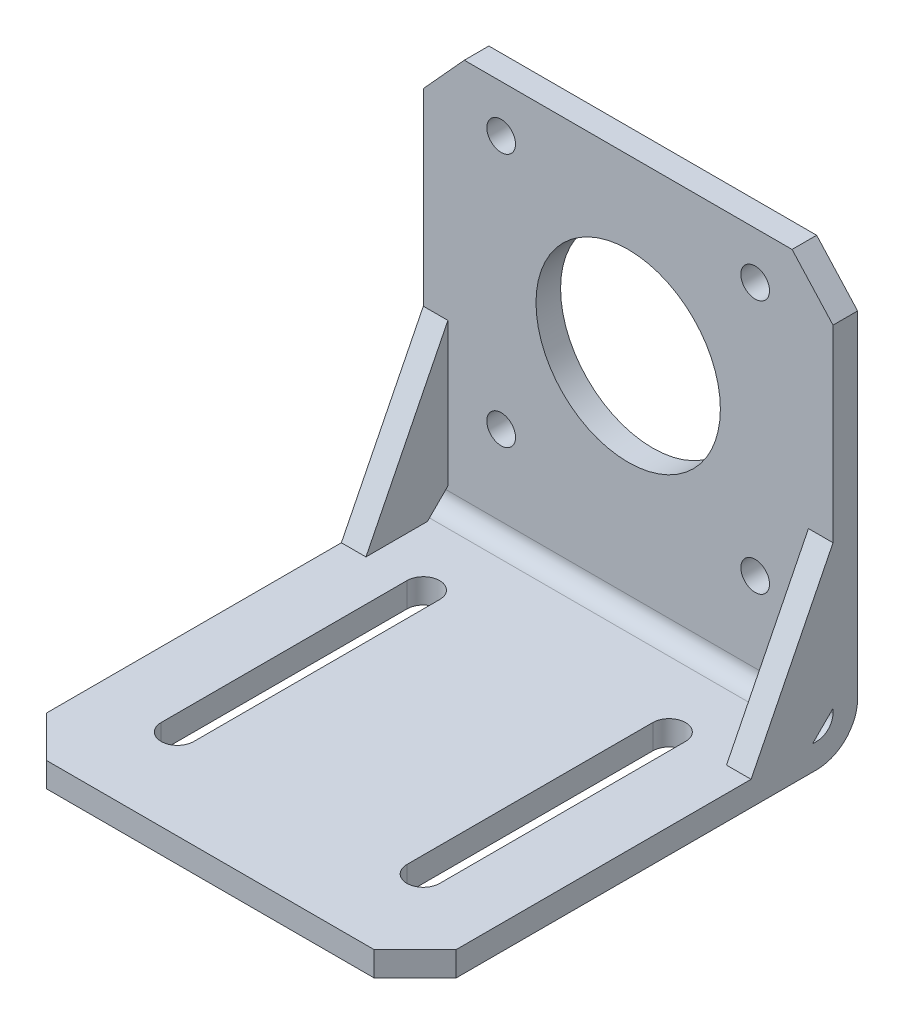
ISO-10303-21;
HEADER;
FILE_DESCRIPTION(('STEP AP214'),'2;1');
FILE_NAME('part.step','',(''),(''),'','','');
FILE_SCHEMA(('AUTOMOTIVE_DESIGN { 1 0 10303 214 1 1 1 1 }'));
ENDSEC;
DATA;
#1=APPLICATION_CONTEXT('core data for automotive mechanical design processes');
#2=APPLICATION_PROTOCOL_DEFINITION('international standard','automotive_design',2000,#1);
#3=PRODUCT_CONTEXT('',#1,'mechanical');
#4=PRODUCT('Part','Part','',(#3));
#5=PRODUCT_RELATED_PRODUCT_CATEGORY('part','',(#4));
#6=PRODUCT_DEFINITION_FORMATION('','',#4);
#7=PRODUCT_DEFINITION_CONTEXT('part definition',#1,'design');
#8=PRODUCT_DEFINITION('design','',#6,#7);
#9=PRODUCT_DEFINITION_SHAPE('','',#8);
#10=(LENGTH_UNIT() NAMED_UNIT(*) SI_UNIT(.MILLI.,.METRE.));
#11=(NAMED_UNIT(*) PLANE_ANGLE_UNIT() SI_UNIT($,.RADIAN.));
#12=(NAMED_UNIT(*) SI_UNIT($,.STERADIAN.) SOLID_ANGLE_UNIT());
#13=UNCERTAINTY_MEASURE_WITH_UNIT(LENGTH_MEASURE(1.E-05),#10,'distance_accuracy_value','');
#14=(GEOMETRIC_REPRESENTATION_CONTEXT(3) GLOBAL_UNCERTAINTY_ASSIGNED_CONTEXT((#13)) GLOBAL_UNIT_ASSIGNED_CONTEXT((#10,
#11,#12)) REPRESENTATION_CONTEXT('',''));
#15=CARTESIAN_POINT('',(0.,0.,0.));
#16=DIRECTION('',(0.,0.,1.));
#17=DIRECTION('',(1.,0.,0.));
#18=AXIS2_PLACEMENT_3D('',#15,#16,#17);
#19=CARTESIAN_POINT('',(0.,0.,3.));
#20=DIRECTION('',(0.,0.,-1.));
#21=DIRECTION('',(-1.,0.,0.));
#22=AXIS2_PLACEMENT_3D('',#19,#20,#21);
#23=PLANE('',#22);
#24=CARTESIAN_POINT('',(0.,30.25,3.));
#25=DIRECTION('',(0.,0.,1.));
#26=DIRECTION('',(1.,0.,0.));
#27=AXIS2_PLACEMENT_3D('',#24,#25,#26);
#28=CIRCLE('',#27,11.25);
#29=CARTESIAN_POINT('',(11.25,30.25,3.));
#30=VERTEX_POINT('',#29);
#31=EDGE_CURVE('E405',#30,#30,#28,.T.);
#32=ORIENTED_EDGE('',*,*,#31,.F.);
#33=EDGE_LOOP('',(#32));
#34=FACE_BOUND('',#33,.T.);
#35=CARTESIAN_POINT('',(15.5,45.75,3.));
#36=DIRECTION('',(0.,0.,1.));
#37=DIRECTION('',(1.,0.,0.));
#38=AXIS2_PLACEMENT_3D('',#35,#36,#37);
#39=CIRCLE('',#38,1.75);
#40=CARTESIAN_POINT('',(17.25,45.75,3.));
#41=VERTEX_POINT('',#40);
#42=EDGE_CURVE('E399',#41,#41,#39,.T.);
#43=ORIENTED_EDGE('',*,*,#42,.F.);
#44=EDGE_LOOP('',(#43));
#45=FACE_BOUND('',#44,.T.);
#46=CARTESIAN_POINT('',(15.5,14.75,3.));
#47=DIRECTION('',(0.,0.,1.));
#48=DIRECTION('',(1.,0.,0.));
#49=AXIS2_PLACEMENT_3D('',#46,#47,#48);
#50=CIRCLE('',#49,1.75);
#51=CARTESIAN_POINT('',(17.25,14.75,3.));
#52=VERTEX_POINT('',#51);
#53=EDGE_CURVE('E393',#52,#52,#50,.T.);
#54=ORIENTED_EDGE('',*,*,#53,.F.);
#55=EDGE_LOOP('',(#54));
#56=FACE_BOUND('',#55,.T.);
#57=CARTESIAN_POINT('',(-15.5,14.75,3.));
#58=DIRECTION('',(0.,0.,1.));
#59=DIRECTION('',(-1.,0.,0.));
#60=AXIS2_PLACEMENT_3D('',#57,#58,#59);
#61=CIRCLE('',#60,1.75);
#62=CARTESIAN_POINT('',(-17.25,14.75,3.));
#63=VERTEX_POINT('',#62);
#64=EDGE_CURVE('E387',#63,#63,#61,.T.);
#65=ORIENTED_EDGE('',*,*,#64,.F.);
#66=EDGE_LOOP('',(#65));
#67=FACE_BOUND('',#66,.T.);
#68=CARTESIAN_POINT('',(-15.5,45.75,3.));
#69=DIRECTION('',(0.,0.,1.));
#70=DIRECTION('',(-1.,0.,0.));
#71=AXIS2_PLACEMENT_3D('',#68,#69,#70);
#72=CIRCLE('',#71,1.75);
#73=CARTESIAN_POINT('',(-17.25,45.75,3.));
#74=VERTEX_POINT('',#73);
#75=EDGE_CURVE('E381',#74,#74,#72,.T.);
#76=ORIENTED_EDGE('',*,*,#75,.F.);
#77=EDGE_LOOP('',(#76));
#78=FACE_BOUND('',#77,.T.);
#79=DIRECTION('',(1.,0.,0.));
#80=VECTOR('',#79,1.);
#81=CARTESIAN_POINT('',(22.,5.49999999999999,3.));
#82=LINE('',#81,#80);
#83=CARTESIAN_POINT('',(22.,5.49999999999999,3.));
#84=VERTEX_POINT('',#83);
#85=CARTESIAN_POINT('',(25.,5.49999999999999,3.));
#86=VERTEX_POINT('',#85);
#87=EDGE_CURVE('E53',#84,#86,#82,.T.);
#88=ORIENTED_EDGE('',*,*,#87,.F.);
#89=DIRECTION('',(0.,1.,0.));
#90=VECTOR('',#89,1.);
#91=CARTESIAN_POINT('',(22.,46.0000000000001,3.));
#92=LINE('',#91,#90);
#93=CARTESIAN_POINT('',(22.,23.,3.));
#94=VERTEX_POINT('',#93);
#95=EDGE_CURVE('E58',#84,#94,#92,.T.);
#96=ORIENTED_EDGE('',*,*,#95,.T.);
#97=DIRECTION('',(1.,0.,0.));
#98=VECTOR('',#97,1.);
#99=CARTESIAN_POINT('',(22.,23.,3.));
#100=LINE('',#99,#98);
#101=CARTESIAN_POINT('',(25.,23.,3.));
#102=VERTEX_POINT('',#101);
#103=EDGE_CURVE('E253',#94,#102,#100,.T.);
#104=ORIENTED_EDGE('',*,*,#103,.T.);
#105=DIRECTION('',(0.,1.,0.));
#106=VECTOR('',#105,1.);
#107=CARTESIAN_POINT('',(25.,46.0000000000001,3.));
#108=LINE('',#107,#106);
#109=CARTESIAN_POINT('',(25.,46.0000000000001,3.));
#110=VERTEX_POINT('',#109);
#111=EDGE_CURVE('E422',#102,#110,#108,.T.);
#112=ORIENTED_EDGE('',*,*,#111,.T.);
#113=DIRECTION('',(-0.672672793996322,0.739940073395936,0.));
#114=VECTOR('',#113,1.);
#115=CARTESIAN_POINT('',(20.,51.5,3.));
#116=LINE('',#115,#114);
#117=CARTESIAN_POINT('',(20.,51.5,3.));
#118=VERTEX_POINT('',#117);
#119=EDGE_CURVE('E411',#110,#118,#116,.T.);
#120=ORIENTED_EDGE('',*,*,#119,.T.);
#121=DIRECTION('',(-1.,0.,0.));
#122=VECTOR('',#121,1.);
#123=CARTESIAN_POINT('',(-20.,51.5,3.));
#124=LINE('',#123,#122);
#125=CARTESIAN_POINT('',(-20.,51.5,3.));
#126=VERTEX_POINT('',#125);
#127=EDGE_CURVE('E414',#118,#126,#124,.T.);
#128=ORIENTED_EDGE('',*,*,#127,.T.);
#129=DIRECTION('',(-0.672672793996322,-0.739940073395936,0.));
#130=VECTOR('',#129,1.);
#131=CARTESIAN_POINT('',(-20.,51.5,3.));
#132=LINE('',#131,#130);
#133=CARTESIAN_POINT('',(-25.,46.0000000000001,3.));
#134=VERTEX_POINT('',#133);
#135=EDGE_CURVE('E417',#126,#134,#132,.T.);
#136=ORIENTED_EDGE('',*,*,#135,.T.);
#137=DIRECTION('',(0.,-1.,0.));
#138=VECTOR('',#137,1.);
#139=CARTESIAN_POINT('',(-25.,46.0000000000001,3.));
#140=LINE('',#139,#138);
#141=CARTESIAN_POINT('',(-25.,23.,3.));
#142=VERTEX_POINT('',#141);
#143=EDGE_CURVE('E420',#134,#142,#140,.T.);
#144=ORIENTED_EDGE('',*,*,#143,.T.);
#145=DIRECTION('',(-1.,0.,0.));
#146=VECTOR('',#145,1.);
#147=CARTESIAN_POINT('',(-22.,23.,3.));
#148=LINE('',#147,#146);
#149=CARTESIAN_POINT('',(-22.,23.,3.));
#150=VERTEX_POINT('',#149);
#151=EDGE_CURVE('E270',#150,#142,#148,.T.);
#152=ORIENTED_EDGE('',*,*,#151,.F.);
#153=DIRECTION('',(0.,1.,0.));
#154=VECTOR('',#153,1.);
#155=CARTESIAN_POINT('',(-22.,0.,3.));
#156=LINE('',#155,#154);
#157=CARTESIAN_POINT('',(-22.,5.5,3.));
#158=VERTEX_POINT('',#157);
#159=EDGE_CURVE('E256',#158,#150,#156,.T.);
#160=ORIENTED_EDGE('',*,*,#159,.F.);
#161=DIRECTION('',(-1.,0.,0.));
#162=VECTOR('',#161,1.);
#163=CARTESIAN_POINT('',(-22.,5.5,3.));
#164=LINE('',#163,#162);
#165=CARTESIAN_POINT('',(-25.,5.5,3.));
#166=VERTEX_POINT('',#165);
#167=EDGE_CURVE('E267',#158,#166,#164,.T.);
#168=ORIENTED_EDGE('',*,*,#167,.T.);
#169=CARTESIAN_POINT('',(-25.,5.,3.));
#170=VERTEX_POINT('',#169);
#171=EDGE_CURVE('E419',#166,#170,#140,.T.);
#172=ORIENTED_EDGE('',*,*,#171,.T.);
#173=DIRECTION('',(1.,0.,0.));
#174=VECTOR('',#173,1.);
#175=CARTESIAN_POINT('',(0.,5.,3.));
#176=LINE('',#175,#174);
#177=CARTESIAN_POINT('',(25.,5.,3.));
#178=VERTEX_POINT('',#177);
#179=EDGE_CURVE('E453',#170,#178,#176,.T.);
#180=ORIENTED_EDGE('',*,*,#179,.T.);
#181=EDGE_CURVE('E423',#178,#86,#108,.T.);
#182=ORIENTED_EDGE('',*,*,#181,.T.);
#183=EDGE_LOOP('',(#88,#96,#104,#112,#120,#128,#136,#144,#152,#160,#168,#172,#180,#182));
#184=FACE_BOUND('',#183,.T.);
#185=ADVANCED_FACE('F38',(#34,#45,#56,#67,#78,#184),#23,.F.);
#186=CARTESIAN_POINT('',(0.,3.,0.));
#187=DIRECTION('',(0.,1.,0.));
#188=DIRECTION('',(0.,0.,1.));
#189=AXIS2_PLACEMENT_3D('',#186,#187,#188);
#190=PLANE('',#189);
#191=CARTESIAN_POINT('',(15.,3.,43.));
#192=DIRECTION('',(0.,-1.,0.));
#193=DIRECTION('',(0.,0.,-1.));
#194=AXIS2_PLACEMENT_3D('',#191,#192,#193);
#195=CIRCLE('',#194,2.);
#196=CARTESIAN_POINT('',(17.,3.,43.));
#197=VERTEX_POINT('',#196);
#198=CARTESIAN_POINT('',(13.,3.,43.));
#199=VERTEX_POINT('',#198);
#200=EDGE_CURVE('E314',#197,#199,#195,.T.);
#201=ORIENTED_EDGE('',*,*,#200,.T.);
#202=DIRECTION('',(0.,0.,-1.));
#203=VECTOR('',#202,1.);
#204=CARTESIAN_POINT('',(13.,3.,43.));
#205=LINE('',#204,#203);
#206=CARTESIAN_POINT('',(13.,3.,13.));
#207=VERTEX_POINT('',#206);
#208=EDGE_CURVE('E317',#199,#207,#205,.T.);
#209=ORIENTED_EDGE('',*,*,#208,.T.);
#210=CARTESIAN_POINT('',(15.,3.,13.));
#211=DIRECTION('',(0.,-1.,0.));
#212=DIRECTION('',(0.,0.,-1.));
#213=AXIS2_PLACEMENT_3D('',#210,#211,#212);
#214=CIRCLE('',#213,2.);
#215=CARTESIAN_POINT('',(17.,3.,13.));
#216=VERTEX_POINT('',#215);
#217=EDGE_CURVE('E321',#207,#216,#214,.T.);
#218=ORIENTED_EDGE('',*,*,#217,.T.);
#219=DIRECTION('',(0.,0.,1.));
#220=VECTOR('',#219,1.);
#221=CARTESIAN_POINT('',(17.,3.,43.));
#222=LINE('',#221,#220);
#223=EDGE_CURVE('E324',#216,#197,#222,.T.);
#224=ORIENTED_EDGE('',*,*,#223,.T.);
#225=EDGE_LOOP('',(#201,#209,#218,#224));
#226=FACE_BOUND('',#225,.T.);
#227=CARTESIAN_POINT('',(-15.,3.,43.));
#228=DIRECTION('',(0.,-1.,0.));
#229=DIRECTION('',(0.,0.,1.));
#230=AXIS2_PLACEMENT_3D('',#227,#228,#229);
#231=CIRCLE('',#230,2.);
#232=CARTESIAN_POINT('',(-13.,3.,43.));
#233=VERTEX_POINT('',#232);
#234=CARTESIAN_POINT('',(-17.,3.,43.));
#235=VERTEX_POINT('',#234);
#236=EDGE_CURVE('E282',#233,#235,#231,.T.);
#237=ORIENTED_EDGE('',*,*,#236,.T.);
#238=DIRECTION('',(0.,0.,-1.));
#239=VECTOR('',#238,1.);
#240=CARTESIAN_POINT('',(-17.,3.,43.));
#241=LINE('',#240,#239);
#242=CARTESIAN_POINT('',(-17.,3.,13.));
#243=VERTEX_POINT('',#242);
#244=EDGE_CURVE('E285',#235,#243,#241,.T.);
#245=ORIENTED_EDGE('',*,*,#244,.T.);
#246=CARTESIAN_POINT('',(-15.,3.,13.));
#247=DIRECTION('',(0.,-1.,0.));
#248=DIRECTION('',(0.,0.,1.));
#249=AXIS2_PLACEMENT_3D('',#246,#247,#248);
#250=CIRCLE('',#249,2.);
#251=CARTESIAN_POINT('',(-13.,3.,13.));
#252=VERTEX_POINT('',#251);
#253=EDGE_CURVE('E289',#243,#252,#250,.T.);
#254=ORIENTED_EDGE('',*,*,#253,.T.);
#255=DIRECTION('',(0.,0.,1.));
#256=VECTOR('',#255,1.);
#257=CARTESIAN_POINT('',(-13.,3.,43.));
#258=LINE('',#257,#256);
#259=EDGE_CURVE('E292',#252,#233,#258,.T.);
#260=ORIENTED_EDGE('',*,*,#259,.T.);
#261=EDGE_LOOP('',(#237,#245,#254,#260));
#262=FACE_BOUND('',#261,.T.);
#263=DIRECTION('',(0.,0.,-1.));
#264=VECTOR('',#263,1.);
#265=CARTESIAN_POINT('',(22.,3.,3.));
#266=LINE('',#265,#264);
#267=CARTESIAN_POINT('',(22.,2.99999999999998,13.));
#268=VERTEX_POINT('',#267);
#269=CARTESIAN_POINT('',(22.,3.,5.50000000000001));
#270=VERTEX_POINT('',#269);
#271=EDGE_CURVE('E225',#268,#270,#266,.T.);
#272=ORIENTED_EDGE('',*,*,#271,.T.);
#273=DIRECTION('',(1.,0.,0.));
#274=VECTOR('',#273,1.);
#275=CARTESIAN_POINT('',(22.,3.,5.50000000000001));
#276=LINE('',#275,#274);
#277=CARTESIAN_POINT('',(25.,3.,5.50000000000001));
#278=VERTEX_POINT('',#277);
#279=EDGE_CURVE('E231',#270,#278,#276,.T.);
#280=ORIENTED_EDGE('',*,*,#279,.T.);
#281=DIRECTION('',(0.,0.,1.));
#282=VECTOR('',#281,1.);
#283=CARTESIAN_POINT('',(25.,3.,0.));
#284=LINE('',#283,#282);
#285=CARTESIAN_POINT('',(25.,3.,5.));
#286=VERTEX_POINT('',#285);
#287=EDGE_CURVE('E361',#286,#278,#284,.T.);
#288=ORIENTED_EDGE('',*,*,#287,.F.);
#289=DIRECTION('',(1.,0.,0.));
#290=VECTOR('',#289,1.);
#291=CARTESIAN_POINT('',(0.,3.,5.));
#292=LINE('',#291,#290);
#293=CARTESIAN_POINT('',(-25.,3.,5.));
#294=VERTEX_POINT('',#293);
#295=EDGE_CURVE('E456',#286,#294,#292,.F.);
#296=ORIENTED_EDGE('',*,*,#295,.T.);
#297=DIRECTION('',(0.,0.,-1.));
#298=VECTOR('',#297,1.);
#299=CARTESIAN_POINT('',(-25.,3.,0.));
#300=LINE('',#299,#298);
#301=CARTESIAN_POINT('',(-25.,3.,5.5));
#302=VERTEX_POINT('',#301);
#303=EDGE_CURVE('E356',#302,#294,#300,.T.);
#304=ORIENTED_EDGE('',*,*,#303,.F.);
#305=DIRECTION('',(-1.,0.,0.));
#306=VECTOR('',#305,1.);
#307=CARTESIAN_POINT('',(-22.,3.,5.5));
#308=LINE('',#307,#306);
#309=CARTESIAN_POINT('',(-22.,3.,5.5));
#310=VERTEX_POINT('',#309);
#311=EDGE_CURVE('E277',#310,#302,#308,.T.);
#312=ORIENTED_EDGE('',*,*,#311,.F.);
#313=DIRECTION('',(0.,0.,-1.));
#314=VECTOR('',#313,1.);
#315=CARTESIAN_POINT('',(-22.,3.,0.));
#316=LINE('',#315,#314);
#317=CARTESIAN_POINT('',(-22.,3.,13.));
#318=VERTEX_POINT('',#317);
#319=EDGE_CURVE('E263',#318,#310,#316,.T.);
#320=ORIENTED_EDGE('',*,*,#319,.F.);
#321=DIRECTION('',(-1.,0.,0.));
#322=VECTOR('',#321,1.);
#323=CARTESIAN_POINT('',(-22.,3.,13.));
#324=LINE('',#323,#322);
#325=CARTESIAN_POINT('',(-25.,3.,13.));
#326=VERTEX_POINT('',#325);
#327=EDGE_CURVE('E274',#318,#326,#324,.T.);
#328=ORIENTED_EDGE('',*,*,#327,.T.);
#329=CARTESIAN_POINT('',(-25.,3.,49.));
#330=VERTEX_POINT('',#329);
#331=EDGE_CURVE('E357',#330,#326,#300,.T.);
#332=ORIENTED_EDGE('',*,*,#331,.F.);
#333=DIRECTION('',(-0.707106781186548,0.,-0.707106781186547));
#334=VECTOR('',#333,1.);
#335=CARTESIAN_POINT('',(-25.,3.,49.));
#336=LINE('',#335,#334);
#337=CARTESIAN_POINT('',(-20.,3.,54.));
#338=VERTEX_POINT('',#337);
#339=EDGE_CURVE('E353',#338,#330,#336,.T.);
#340=ORIENTED_EDGE('',*,*,#339,.F.);
#341=DIRECTION('',(-1.,0.,0.));
#342=VECTOR('',#341,1.);
#343=CARTESIAN_POINT('',(-20.,3.,54.));
#344=LINE('',#343,#342);
#345=CARTESIAN_POINT('',(20.,3.,54.));
#346=VERTEX_POINT('',#345);
#347=EDGE_CURVE('E349',#346,#338,#344,.T.);
#348=ORIENTED_EDGE('',*,*,#347,.F.);
#349=DIRECTION('',(-0.707106781186548,0.,0.707106781186547));
#350=VECTOR('',#349,1.);
#351=CARTESIAN_POINT('',(25.,3.,49.));
#352=LINE('',#351,#350);
#353=CARTESIAN_POINT('',(25.,3.,49.));
#354=VERTEX_POINT('',#353);
#355=EDGE_CURVE('E346',#354,#346,#352,.T.);
#356=ORIENTED_EDGE('',*,*,#355,.F.);
#357=CARTESIAN_POINT('',(25.,2.99999999999999,13.));
#358=VERTEX_POINT('',#357);
#359=EDGE_CURVE('E360',#358,#354,#284,.T.);
#360=ORIENTED_EDGE('',*,*,#359,.F.);
#361=DIRECTION('',(1.,0.,0.));
#362=VECTOR('',#361,1.);
#363=CARTESIAN_POINT('',(22.,2.99999999999998,13.));
#364=LINE('',#363,#362);
#365=EDGE_CURVE('E239',#268,#358,#364,.T.);
#366=ORIENTED_EDGE('',*,*,#365,.F.);
#367=EDGE_LOOP('',(#272,#280,#288,#296,#304,#312,#320,#328,#332,#340,#348,#356,#360,#366));
#368=FACE_BOUND('',#367,.T.);
#369=ADVANCED_FACE('F242',(#226,#262,#368),#190,.T.);
#370=CARTESIAN_POINT('',(0.,0.,0.));
#371=DIRECTION('',(0.,0.,-1.));
#372=DIRECTION('',(-1.,0.,0.));
#373=AXIS2_PLACEMENT_3D('',#370,#371,#372);
#374=PLANE('',#373);
#375=DIRECTION('',(0.,1.,0.));
#376=VECTOR('',#375,1.);
#377=CARTESIAN_POINT('',(25.,46.0000000000001,0.));
#378=LINE('',#377,#376);
#379=CARTESIAN_POINT('',(25.,4.99999999999999,0.));
#380=VERTEX_POINT('',#379);
#381=CARTESIAN_POINT('',(25.,46.0000000000001,0.));
#382=VERTEX_POINT('',#381);
#383=EDGE_CURVE('E415',#380,#382,#378,.T.);
#384=ORIENTED_EDGE('',*,*,#383,.F.);
#385=DIRECTION('',(1.,0.,0.));
#386=VECTOR('',#385,1.);
#387=CARTESIAN_POINT('',(-25.,4.99999999999999,0.));
#388=LINE('',#387,#386);
#389=CARTESIAN_POINT('',(-25.,4.99999999999999,0.));
#390=VERTEX_POINT('',#389);
#391=EDGE_CURVE('E46',#380,#390,#388,.F.);
#392=ORIENTED_EDGE('',*,*,#391,.T.);
#393=DIRECTION('',(0.,-1.,0.));
#394=VECTOR('',#393,1.);
#395=CARTESIAN_POINT('',(-25.,46.0000000000001,0.));
#396=LINE('',#395,#394);
#397=CARTESIAN_POINT('',(-25.,46.0000000000001,0.));
#398=VERTEX_POINT('',#397);
#399=EDGE_CURVE('E432',#398,#390,#396,.T.);
#400=ORIENTED_EDGE('',*,*,#399,.F.);
#401=DIRECTION('',(-0.672672793996322,-0.739940073395936,0.));
#402=VECTOR('',#401,1.);
#403=CARTESIAN_POINT('',(-20.,51.5,0.));
#404=LINE('',#403,#402);
#405=CARTESIAN_POINT('',(-20.,51.5,0.));
#406=VERTEX_POINT('',#405);
#407=EDGE_CURVE('E430',#406,#398,#404,.T.);
#408=ORIENTED_EDGE('',*,*,#407,.F.);
#409=DIRECTION('',(-1.,0.,0.));
#410=VECTOR('',#409,1.);
#411=CARTESIAN_POINT('',(-20.,51.5,0.));
#412=LINE('',#411,#410);
#413=CARTESIAN_POINT('',(20.,51.5,0.));
#414=VERTEX_POINT('',#413);
#415=EDGE_CURVE('E428',#414,#406,#412,.T.);
#416=ORIENTED_EDGE('',*,*,#415,.F.);
#417=DIRECTION('',(-0.672672793996322,0.739940073395936,0.));
#418=VECTOR('',#417,1.);
#419=CARTESIAN_POINT('',(20.,51.5,0.));
#420=LINE('',#419,#418);
#421=EDGE_CURVE('E408',#382,#414,#420,.T.);
#422=ORIENTED_EDGE('',*,*,#421,.F.);
#423=EDGE_LOOP('',(#384,#392,#400,#408,#416,#422));
#424=FACE_BOUND('',#423,.T.);
#425=CARTESIAN_POINT('',(-15.5,14.75,0.));
#426=DIRECTION('',(0.,0.,1.));
#427=DIRECTION('',(-1.,0.,0.));
#428=AXIS2_PLACEMENT_3D('',#425,#426,#427);
#429=CIRCLE('',#428,1.75);
#430=CARTESIAN_POINT('',(-17.25,14.75,0.));
#431=VERTEX_POINT('',#430);
#432=EDGE_CURVE('E384',#431,#431,#429,.T.);
#433=ORIENTED_EDGE('',*,*,#432,.T.);
#434=EDGE_LOOP('',(#433));
#435=FACE_BOUND('',#434,.T.);
#436=CARTESIAN_POINT('',(15.5,45.75,0.));
#437=DIRECTION('',(0.,0.,1.));
#438=DIRECTION('',(1.,0.,0.));
#439=AXIS2_PLACEMENT_3D('',#436,#437,#438);
#440=CIRCLE('',#439,1.75);
#441=CARTESIAN_POINT('',(17.25,45.75,0.));
#442=VERTEX_POINT('',#441);
#443=EDGE_CURVE('E396',#442,#442,#440,.T.);
#444=ORIENTED_EDGE('',*,*,#443,.T.);
#445=EDGE_LOOP('',(#444));
#446=FACE_BOUND('',#445,.T.);
#447=CARTESIAN_POINT('',(0.,30.25,0.));
#448=DIRECTION('',(0.,0.,1.));
#449=DIRECTION('',(1.,0.,0.));
#450=AXIS2_PLACEMENT_3D('',#447,#448,#449);
#451=CIRCLE('',#450,11.25);
#452=CARTESIAN_POINT('',(11.25,30.25,0.));
#453=VERTEX_POINT('',#452);
#454=EDGE_CURVE('E402',#453,#453,#451,.T.);
#455=ORIENTED_EDGE('',*,*,#454,.T.);
#456=EDGE_LOOP('',(#455));
#457=FACE_BOUND('',#456,.T.);
#458=CARTESIAN_POINT('',(15.5,14.75,0.));
#459=DIRECTION('',(0.,0.,1.));
#460=DIRECTION('',(1.,0.,0.));
#461=AXIS2_PLACEMENT_3D('',#458,#459,#460);
#462=CIRCLE('',#461,1.75);
#463=CARTESIAN_POINT('',(17.25,14.75,0.));
#464=VERTEX_POINT('',#463);
#465=EDGE_CURVE('E390',#464,#464,#462,.T.);
#466=ORIENTED_EDGE('',*,*,#465,.T.);
#467=EDGE_LOOP('',(#466));
#468=FACE_BOUND('',#467,.T.);
#469=CARTESIAN_POINT('',(-15.5,45.75,0.));
#470=DIRECTION('',(0.,0.,1.));
#471=DIRECTION('',(-1.,0.,0.));
#472=AXIS2_PLACEMENT_3D('',#469,#470,#471);
#473=CIRCLE('',#472,1.75);
#474=CARTESIAN_POINT('',(-17.25,45.75,0.));
#475=VERTEX_POINT('',#474);
#476=EDGE_CURVE('E374',#475,#475,#473,.T.);
#477=ORIENTED_EDGE('',*,*,#476,.T.);
#478=EDGE_LOOP('',(#477));
#479=FACE_BOUND('',#478,.T.);
#480=ADVANCED_FACE('F472',(#424,#435,#446,#457,#468,#479),#374,.T.);
#481=CARTESIAN_POINT('',(20.,51.5,3.));
#482=DIRECTION('',(-0.739940073395935,-0.672672793996321,0.));
#483=DIRECTION('',(0.672672793996322,-0.739940073395935,0.));
#484=AXIS2_PLACEMENT_3D('',#481,#482,#483);
#485=PLANE('',#484);
#486=ORIENTED_EDGE('',*,*,#421,.T.);
#487=DIRECTION('',(0.,0.,-1.));
#488=VECTOR('',#487,1.);
#489=CARTESIAN_POINT('',(20.,51.5,3.));
#490=LINE('',#489,#488);
#491=EDGE_CURVE('E450',#118,#414,#490,.T.);
#492=ORIENTED_EDGE('',*,*,#491,.F.);
#493=ORIENTED_EDGE('',*,*,#119,.F.);
#494=DIRECTION('',(0.,0.,-1.));
#495=VECTOR('',#494,1.);
#496=CARTESIAN_POINT('',(25.,46.0000000000001,3.));
#497=LINE('',#496,#495);
#498=EDGE_CURVE('E425',#110,#382,#497,.T.);
#499=ORIENTED_EDGE('',*,*,#498,.T.);
#500=EDGE_LOOP('',(#486,#492,#493,#499));
#501=FACE_BOUND('',#500,.T.);
#502=ADVANCED_FACE('F519',(#501),#485,.F.);
#503=CARTESIAN_POINT('',(-20.,51.5,3.));
#504=DIRECTION('',(0.,-1.,0.));
#505=DIRECTION('',(0.,0.,-1.));
#506=AXIS2_PLACEMENT_3D('',#503,#504,#505);
#507=PLANE('',#506);
#508=ORIENTED_EDGE('',*,*,#415,.T.);
#509=DIRECTION('',(0.,0.,-1.));
#510=VECTOR('',#509,1.);
#511=CARTESIAN_POINT('',(-20.,51.5,3.));
#512=LINE('',#511,#510);
#513=EDGE_CURVE('E447',#126,#406,#512,.T.);
#514=ORIENTED_EDGE('',*,*,#513,.F.);
#515=ORIENTED_EDGE('',*,*,#127,.F.);
#516=ORIENTED_EDGE('',*,*,#491,.T.);
#517=EDGE_LOOP('',(#508,#514,#515,#516));
#518=FACE_BOUND('',#517,.T.);
#519=ADVANCED_FACE('F516',(#518),#507,.F.);
#520=CARTESIAN_POINT('',(-20.,51.5,3.));
#521=DIRECTION('',(0.739940073395935,-0.672672793996321,0.));
#522=DIRECTION('',(0.672672793996322,0.739940073395935,0.));
#523=AXIS2_PLACEMENT_3D('',#520,#521,#522);
#524=PLANE('',#523);
#525=ORIENTED_EDGE('',*,*,#407,.T.);
#526=DIRECTION('',(0.,0.,-1.));
#527=VECTOR('',#526,1.);
#528=CARTESIAN_POINT('',(-25.,46.0000000000001,3.));
#529=LINE('',#528,#527);
#530=EDGE_CURVE('E444',#134,#398,#529,.T.);
#531=ORIENTED_EDGE('',*,*,#530,.F.);
#532=ORIENTED_EDGE('',*,*,#135,.F.);
#533=ORIENTED_EDGE('',*,*,#513,.T.);
#534=EDGE_LOOP('',(#525,#531,#532,#533));
#535=FACE_BOUND('',#534,.T.);
#536=ADVANCED_FACE('F513',(#535),#524,.F.);
#537=CARTESIAN_POINT('',(-25.,46.0000000000001,3.));
#538=DIRECTION('',(1.,0.,0.));
#539=DIRECTION('',(0.,1.,0.));
#540=AXIS2_PLACEMENT_3D('',#537,#538,#539);
#541=PLANE('',#540);
#542=DIRECTION('',(0.,-0.894427190999916,0.447213595499958));
#543=VECTOR('',#542,1.);
#544=CARTESIAN_POINT('',(-25.,5.80000000000001,11.6));
#545=LINE('',#544,#543);
#546=EDGE_CURVE('E260',#142,#326,#545,.T.);
#547=ORIENTED_EDGE('',*,*,#546,.F.);
#548=ORIENTED_EDGE('',*,*,#143,.F.);
#549=ORIENTED_EDGE('',*,*,#530,.T.);
#550=ORIENTED_EDGE('',*,*,#399,.T.);
#551=CARTESIAN_POINT('',(-25.,4.99999999999999,5.));
#552=DIRECTION('',(1.,0.,0.));
#553=DIRECTION('',(0.,1.,0.));
#554=AXIS2_PLACEMENT_3D('',#551,#552,#553);
#555=CIRCLE('',#554,5.);
#556=CARTESIAN_POINT('',(-25.,0.,5.));
#557=VERTEX_POINT('',#556);
#558=EDGE_CURVE('E11',#390,#557,#555,.F.);
#559=ORIENTED_EDGE('',*,*,#558,.T.);
#560=DIRECTION('',(0.,0.,-1.));
#561=VECTOR('',#560,1.);
#562=CARTESIAN_POINT('',(-25.,0.,3.));
#563=LINE('',#562,#561);
#564=CARTESIAN_POINT('',(-25.,0.,49.));
#565=VERTEX_POINT('',#564);
#566=EDGE_CURVE('E441',#565,#557,#563,.T.);
#567=ORIENTED_EDGE('',*,*,#566,.F.);
#568=DIRECTION('',(0.,-1.,0.));
#569=VECTOR('',#568,1.);
#570=CARTESIAN_POINT('',(-25.,3.,49.));
#571=LINE('',#570,#569);
#572=EDGE_CURVE('E375',#330,#565,#571,.T.);
#573=ORIENTED_EDGE('',*,*,#572,.F.);
#574=ORIENTED_EDGE('',*,*,#331,.T.);
#575=EDGE_LOOP('',(#547,#548,#549,#550,#559,#567,#573,#574));
#576=FACE_BOUND('',#575,.T.);
#577=ORIENTED_EDGE('',*,*,#171,.F.);
#578=DIRECTION('',(0.,-0.707106781186547,0.707106781186548));
#579=VECTOR('',#578,1.);
#580=CARTESIAN_POINT('',(-25.,4.25000000000001,4.25));
#581=LINE('',#580,#579);
#582=EDGE_CURVE('E238',#166,#302,#581,.T.);
#583=ORIENTED_EDGE('',*,*,#582,.T.);
#584=ORIENTED_EDGE('',*,*,#303,.T.);
#585=CARTESIAN_POINT('',(-25.,5.,5.));
#586=DIRECTION('',(1.,0.,0.));
#587=DIRECTION('',(0.,1.,0.));
#588=AXIS2_PLACEMENT_3D('',#585,#586,#587);
#589=CIRCLE('',#588,2.);
#590=EDGE_CURVE('E461',#294,#170,#589,.T.);
#591=ORIENTED_EDGE('',*,*,#590,.T.);
#592=EDGE_LOOP('',(#577,#583,#584,#591));
#593=FACE_BOUND('',#592,.T.);
#594=ADVANCED_FACE('F480',(#576,#593),#541,.F.);
#595=CARTESIAN_POINT('',(25.,0.,3.));
#596=DIRECTION('',(0.,1.,0.));
#597=DIRECTION('',(0.,0.,1.));
#598=AXIS2_PLACEMENT_3D('',#595,#596,#597);
#599=PLANE('',#598);
#600=ORIENTED_EDGE('',*,*,#566,.T.);
#601=DIRECTION('',(1.,0.,0.));
#602=VECTOR('',#601,1.);
#603=CARTESIAN_POINT('',(25.,0.,5.));
#604=LINE('',#603,#602);
#605=CARTESIAN_POINT('',(25.,0.,5.));
#606=VERTEX_POINT('',#605);
#607=EDGE_CURVE('E464',#557,#606,#604,.T.);
#608=ORIENTED_EDGE('',*,*,#607,.T.);
#609=DIRECTION('',(0.,0.,-1.));
#610=VECTOR('',#609,1.);
#611=CARTESIAN_POINT('',(25.,0.,3.));
#612=LINE('',#611,#610);
#613=CARTESIAN_POINT('',(25.,0.,49.));
#614=VERTEX_POINT('',#613);
#615=EDGE_CURVE('E438',#614,#606,#612,.T.);
#616=ORIENTED_EDGE('',*,*,#615,.F.);
#617=DIRECTION('',(-0.707106781186548,0.,0.707106781186547));
#618=VECTOR('',#617,1.);
#619=CARTESIAN_POINT('',(25.,0.,49.));
#620=LINE('',#619,#618);
#621=CARTESIAN_POINT('',(20.,0.,54.));
#622=VERTEX_POINT('',#621);
#623=EDGE_CURVE('E339',#614,#622,#620,.T.);
#624=ORIENTED_EDGE('',*,*,#623,.T.);
#625=DIRECTION('',(-1.,0.,0.));
#626=VECTOR('',#625,1.);
#627=CARTESIAN_POINT('',(-20.,0.,54.));
#628=LINE('',#627,#626);
#629=CARTESIAN_POINT('',(-20.,0.,54.));
#630=VERTEX_POINT('',#629);
#631=EDGE_CURVE('E366',#622,#630,#628,.T.);
#632=ORIENTED_EDGE('',*,*,#631,.T.);
#633=DIRECTION('',(-0.707106781186548,0.,-0.707106781186547));
#634=VECTOR('',#633,1.);
#635=CARTESIAN_POINT('',(-25.,0.,49.));
#636=LINE('',#635,#634);
#637=EDGE_CURVE('E350',#630,#565,#636,.T.);
#638=ORIENTED_EDGE('',*,*,#637,.T.);
#639=EDGE_LOOP('',(#600,#608,#616,#624,#632,#638));
#640=FACE_BOUND('',#639,.T.);
#641=DIRECTION('',(0.,0.,-1.));
#642=VECTOR('',#641,1.);
#643=CARTESIAN_POINT('',(-17.,0.,43.));
#644=LINE('',#643,#642);
#645=CARTESIAN_POINT('',(-17.,0.,43.));
#646=VERTEX_POINT('',#645);
#647=CARTESIAN_POINT('',(-17.,0.,13.));
#648=VERTEX_POINT('',#647);
#649=EDGE_CURVE('E297',#646,#648,#644,.T.);
#650=ORIENTED_EDGE('',*,*,#649,.F.);
#651=CARTESIAN_POINT('',(-15.,0.,43.));
#652=DIRECTION('',(0.,-1.,0.));
#653=DIRECTION('',(0.,0.,1.));
#654=AXIS2_PLACEMENT_3D('',#651,#652,#653);
#655=CIRCLE('',#654,2.);
#656=CARTESIAN_POINT('',(-13.,0.,43.));
#657=VERTEX_POINT('',#656);
#658=EDGE_CURVE('E273',#657,#646,#655,.T.);
#659=ORIENTED_EDGE('',*,*,#658,.F.);
#660=DIRECTION('',(0.,0.,1.));
#661=VECTOR('',#660,1.);
#662=CARTESIAN_POINT('',(-13.,0.,43.));
#663=LINE('',#662,#661);
#664=CARTESIAN_POINT('',(-13.,0.,13.));
#665=VERTEX_POINT('',#664);
#666=EDGE_CURVE('E286',#665,#657,#663,.T.);
#667=ORIENTED_EDGE('',*,*,#666,.F.);
#668=CARTESIAN_POINT('',(-15.,0.,13.));
#669=DIRECTION('',(0.,-1.,0.));
#670=DIRECTION('',(0.,0.,1.));
#671=AXIS2_PLACEMENT_3D('',#668,#669,#670);
#672=CIRCLE('',#671,2.);
#673=EDGE_CURVE('E300',#648,#665,#672,.T.);
#674=ORIENTED_EDGE('',*,*,#673,.F.);
#675=EDGE_LOOP('',(#650,#659,#667,#674));
#676=FACE_BOUND('',#675,.T.);
#677=DIRECTION('',(0.,0.,-1.));
#678=VECTOR('',#677,1.);
#679=CARTESIAN_POINT('',(13.,0.,43.));
#680=LINE('',#679,#678);
#681=CARTESIAN_POINT('',(13.,0.,43.));
#682=VERTEX_POINT('',#681);
#683=CARTESIAN_POINT('',(13.,0.,13.));
#684=VERTEX_POINT('',#683);
#685=EDGE_CURVE('E329',#682,#684,#680,.T.);
#686=ORIENTED_EDGE('',*,*,#685,.F.);
#687=CARTESIAN_POINT('',(15.,0.,43.));
#688=DIRECTION('',(0.,-1.,0.));
#689=DIRECTION('',(0.,0.,-1.));
#690=AXIS2_PLACEMENT_3D('',#687,#688,#689);
#691=CIRCLE('',#690,2.);
#692=CARTESIAN_POINT('',(17.,0.,43.));
#693=VERTEX_POINT('',#692);
#694=EDGE_CURVE('E307',#693,#682,#691,.T.);
#695=ORIENTED_EDGE('',*,*,#694,.F.);
#696=DIRECTION('',(0.,0.,1.));
#697=VECTOR('',#696,1.);
#698=CARTESIAN_POINT('',(17.,0.,43.));
#699=LINE('',#698,#697);
#700=CARTESIAN_POINT('',(17.,0.,13.));
#701=VERTEX_POINT('',#700);
#702=EDGE_CURVE('E318',#701,#693,#699,.T.);
#703=ORIENTED_EDGE('',*,*,#702,.F.);
#704=CARTESIAN_POINT('',(15.,0.,13.));
#705=DIRECTION('',(0.,-1.,0.));
#706=DIRECTION('',(0.,0.,-1.));
#707=AXIS2_PLACEMENT_3D('',#704,#705,#706);
#708=CIRCLE('',#707,2.);
#709=EDGE_CURVE('E332',#684,#701,#708,.T.);
#710=ORIENTED_EDGE('',*,*,#709,.F.);
#711=EDGE_LOOP('',(#686,#695,#703,#710));
#712=FACE_BOUND('',#711,.T.);
#713=ADVANCED_FACE('F486',(#640,#676,#712),#599,.F.);
#714=CARTESIAN_POINT('',(25.,46.0000000000001,3.));
#715=DIRECTION('',(-1.,0.,0.));
#716=DIRECTION('',(0.,-1.,0.));
#717=AXIS2_PLACEMENT_3D('',#714,#715,#716);
#718=PLANE('',#717);
#719=ORIENTED_EDGE('',*,*,#287,.T.);
#720=DIRECTION('',(0.,-0.707106781186547,0.707106781186548));
#721=VECTOR('',#720,1.);
#722=CARTESIAN_POINT('',(25.,25.75,-17.2500000000001));
#723=LINE('',#722,#721);
#724=EDGE_CURVE('E234',#86,#278,#723,.T.);
#725=ORIENTED_EDGE('',*,*,#724,.F.);
#726=ORIENTED_EDGE('',*,*,#181,.F.);
#727=CARTESIAN_POINT('',(25.,5.,5.));
#728=DIRECTION('',(-1.,0.,0.));
#729=DIRECTION('',(0.,-1.,0.));
#730=AXIS2_PLACEMENT_3D('',#727,#728,#729);
#731=CIRCLE('',#730,2.);
#732=EDGE_CURVE('E459',#178,#286,#731,.T.);
#733=ORIENTED_EDGE('',*,*,#732,.T.);
#734=EDGE_LOOP('',(#719,#725,#726,#733));
#735=FACE_BOUND('',#734,.T.);
#736=ORIENTED_EDGE('',*,*,#615,.T.);
#737=CARTESIAN_POINT('',(25.,4.99999999999999,5.));
#738=DIRECTION('',(-1.,0.,0.));
#739=DIRECTION('',(0.,-1.,0.));
#740=AXIS2_PLACEMENT_3D('',#737,#738,#739);
#741=CIRCLE('',#740,5.);
#742=EDGE_CURVE('E467',#606,#380,#741,.F.);
#743=ORIENTED_EDGE('',*,*,#742,.T.);
#744=ORIENTED_EDGE('',*,*,#383,.T.);
#745=ORIENTED_EDGE('',*,*,#498,.F.);
#746=ORIENTED_EDGE('',*,*,#111,.F.);
#747=DIRECTION('',(0.,-0.894427190999916,0.447213595499958));
#748=VECTOR('',#747,1.);
#749=CARTESIAN_POINT('',(25.,41.4000000000001,-6.20000000000006));
#750=LINE('',#749,#748);
#751=EDGE_CURVE('E228',#102,#358,#750,.T.);
#752=ORIENTED_EDGE('',*,*,#751,.T.);
#753=ORIENTED_EDGE('',*,*,#359,.T.);
#754=DIRECTION('',(0.,-1.,0.));
#755=VECTOR('',#754,1.);
#756=CARTESIAN_POINT('',(25.,3.,49.));
#757=LINE('',#756,#755);
#758=EDGE_CURVE('E371',#354,#614,#757,.T.);
#759=ORIENTED_EDGE('',*,*,#758,.T.);
#760=EDGE_LOOP('',(#736,#743,#744,#745,#746,#752,#753,#759));
#761=FACE_BOUND('',#760,.T.);
#762=ADVANCED_FACE('F489',(#735,#761),#718,.F.);
#763=CARTESIAN_POINT('',(0.,30.25,3.));
#764=DIRECTION('',(0.,0.,-1.));
#765=DIRECTION('',(-1.,0.,0.));
#766=AXIS2_PLACEMENT_3D('',#763,#764,#765);
#767=CYLINDRICAL_SURFACE('',#766,11.25);
#768=ORIENTED_EDGE('',*,*,#31,.T.);
#769=EDGE_LOOP('',(#768));
#770=FACE_BOUND('',#769,.T.);
#771=ORIENTED_EDGE('',*,*,#454,.F.);
#772=EDGE_LOOP('',(#771));
#773=FACE_BOUND('',#772,.T.);
#774=ADVANCED_FACE('F545',(#770,#773),#767,.F.);
#775=CARTESIAN_POINT('',(15.5,45.75,3.));
#776=DIRECTION('',(0.,0.,-1.));
#777=DIRECTION('',(-1.,0.,0.));
#778=AXIS2_PLACEMENT_3D('',#775,#776,#777);
#779=CYLINDRICAL_SURFACE('',#778,1.75);
#780=ORIENTED_EDGE('',*,*,#42,.T.);
#781=EDGE_LOOP('',(#780));
#782=FACE_BOUND('',#781,.T.);
#783=ORIENTED_EDGE('',*,*,#443,.F.);
#784=EDGE_LOOP('',(#783));
#785=FACE_BOUND('',#784,.T.);
#786=ADVANCED_FACE('F635',(#782,#785),#779,.F.);
#787=CARTESIAN_POINT('',(15.5,14.75,3.));
#788=DIRECTION('',(0.,0.,-1.));
#789=DIRECTION('',(-1.,0.,0.));
#790=AXIS2_PLACEMENT_3D('',#787,#788,#789);
#791=CYLINDRICAL_SURFACE('',#790,1.75);
#792=ORIENTED_EDGE('',*,*,#53,.T.);
#793=EDGE_LOOP('',(#792));
#794=FACE_BOUND('',#793,.T.);
#795=ORIENTED_EDGE('',*,*,#465,.F.);
#796=EDGE_LOOP('',(#795));
#797=FACE_BOUND('',#796,.T.);
#798=ADVANCED_FACE('F632',(#794,#797),#791,.F.);
#799=CARTESIAN_POINT('',(-15.5,14.75,3.));
#800=DIRECTION('',(0.,0.,-1.));
#801=DIRECTION('',(-1.,0.,0.));
#802=AXIS2_PLACEMENT_3D('',#799,#800,#801);
#803=CYLINDRICAL_SURFACE('',#802,1.75);
#804=ORIENTED_EDGE('',*,*,#64,.T.);
#805=EDGE_LOOP('',(#804));
#806=FACE_BOUND('',#805,.T.);
#807=ORIENTED_EDGE('',*,*,#432,.F.);
#808=EDGE_LOOP('',(#807));
#809=FACE_BOUND('',#808,.T.);
#810=ADVANCED_FACE('F628',(#806,#809),#803,.F.);
#811=CARTESIAN_POINT('',(-15.5,45.75,3.));
#812=DIRECTION('',(0.,0.,-1.));
#813=DIRECTION('',(-1.,0.,0.));
#814=AXIS2_PLACEMENT_3D('',#811,#812,#813);
#815=CYLINDRICAL_SURFACE('',#814,1.75);
#816=ORIENTED_EDGE('',*,*,#75,.T.);
#817=EDGE_LOOP('',(#816));
#818=FACE_BOUND('',#817,.T.);
#819=ORIENTED_EDGE('',*,*,#476,.F.);
#820=EDGE_LOOP('',(#819));
#821=FACE_BOUND('',#820,.T.);
#822=ADVANCED_FACE('F625',(#818,#821),#815,.F.);
#823=CARTESIAN_POINT('',(25.,3.,49.));
#824=DIRECTION('',(0.707106781186547,0.,0.707106781186548));
#825=DIRECTION('',(0.707106781186548,0.,-0.707106781186547));
#826=AXIS2_PLACEMENT_3D('',#823,#824,#825);
#827=PLANE('',#826);
#828=ORIENTED_EDGE('',*,*,#623,.F.);
#829=ORIENTED_EDGE('',*,*,#758,.F.);
#830=ORIENTED_EDGE('',*,*,#355,.T.);
#831=DIRECTION('',(0.,-1.,0.));
#832=VECTOR('',#831,1.);
#833=CARTESIAN_POINT('',(20.,3.,54.));
#834=LINE('',#833,#832);
#835=EDGE_CURVE('E363',#346,#622,#834,.T.);
#836=ORIENTED_EDGE('',*,*,#835,.T.);
#837=EDGE_LOOP('',(#828,#829,#830,#836));
#838=FACE_BOUND('',#837,.T.);
#839=ADVANCED_FACE('F494',(#838),#827,.T.);
#840=CARTESIAN_POINT('',(-25.,3.,49.));
#841=DIRECTION('',(-0.707106781186547,0.,0.707106781186548));
#842=DIRECTION('',(0.707106781186548,0.,0.707106781186547));
#843=AXIS2_PLACEMENT_3D('',#840,#841,#842);
#844=PLANE('',#843);
#845=ORIENTED_EDGE('',*,*,#637,.F.);
#846=DIRECTION('',(0.,-1.,0.));
#847=VECTOR('',#846,1.);
#848=CARTESIAN_POINT('',(-20.,3.,54.));
#849=LINE('',#848,#847);
#850=EDGE_CURVE('E378',#338,#630,#849,.T.);
#851=ORIENTED_EDGE('',*,*,#850,.F.);
#852=ORIENTED_EDGE('',*,*,#339,.T.);
#853=ORIENTED_EDGE('',*,*,#572,.T.);
#854=EDGE_LOOP('',(#845,#851,#852,#853));
#855=FACE_BOUND('',#854,.T.);
#856=ADVANCED_FACE('F502',(#855),#844,.T.);
#857=CARTESIAN_POINT('',(-20.,3.,54.));
#858=DIRECTION('',(0.,0.,1.));
#859=DIRECTION('',(1.,0.,0.));
#860=AXIS2_PLACEMENT_3D('',#857,#858,#859);
#861=PLANE('',#860);
#862=ORIENTED_EDGE('',*,*,#631,.F.);
#863=ORIENTED_EDGE('',*,*,#835,.F.);
#864=ORIENTED_EDGE('',*,*,#347,.T.);
#865=ORIENTED_EDGE('',*,*,#850,.T.);
#866=EDGE_LOOP('',(#862,#863,#864,#865));
#867=FACE_BOUND('',#866,.T.);
#868=ADVANCED_FACE('F498',(#867),#861,.T.);
#869=CARTESIAN_POINT('',(15.,3.,43.));
#870=DIRECTION('',(0.,-1.,0.));
#871=DIRECTION('',(0.,0.,-1.));
#872=AXIS2_PLACEMENT_3D('',#869,#870,#871);
#873=CYLINDRICAL_SURFACE('',#872,2.);
#874=ORIENTED_EDGE('',*,*,#694,.T.);
#875=DIRECTION('',(0.,-1.,0.));
#876=VECTOR('',#875,1.);
#877=CARTESIAN_POINT('',(13.,3.,43.));
#878=LINE('',#877,#876);
#879=EDGE_CURVE('E327',#199,#682,#878,.T.);
#880=ORIENTED_EDGE('',*,*,#879,.F.);
#881=ORIENTED_EDGE('',*,*,#200,.F.);
#882=DIRECTION('',(0.,-1.,0.));
#883=VECTOR('',#882,1.);
#884=CARTESIAN_POINT('',(17.,3.,43.));
#885=LINE('',#884,#883);
#886=EDGE_CURVE('E337',#197,#693,#885,.T.);
#887=ORIENTED_EDGE('',*,*,#886,.T.);
#888=EDGE_LOOP('',(#874,#880,#881,#887));
#889=FACE_BOUND('',#888,.T.);
#890=ADVANCED_FACE('F608',(#889),#873,.F.);
#891=CARTESIAN_POINT('',(17.,3.,43.));
#892=DIRECTION('',(1.,0.,0.));
#893=DIRECTION('',(0.,0.,-1.));
#894=AXIS2_PLACEMENT_3D('',#891,#892,#893);
#895=PLANE('',#894);
#896=ORIENTED_EDGE('',*,*,#702,.T.);
#897=ORIENTED_EDGE('',*,*,#886,.F.);
#898=ORIENTED_EDGE('',*,*,#223,.F.);
#899=DIRECTION('',(0.,-1.,0.));
#900=VECTOR('',#899,1.);
#901=CARTESIAN_POINT('',(17.,3.,13.));
#902=LINE('',#901,#900);
#903=EDGE_CURVE('E340',#216,#701,#902,.T.);
#904=ORIENTED_EDGE('',*,*,#903,.T.);
#905=EDGE_LOOP('',(#896,#897,#898,#904));
#906=FACE_BOUND('',#905,.T.);
#907=ADVANCED_FACE('F604',(#906),#895,.F.);
#908=CARTESIAN_POINT('',(15.,3.,13.));
#909=DIRECTION('',(0.,-1.,0.));
#910=DIRECTION('',(0.,0.,-1.));
#911=AXIS2_PLACEMENT_3D('',#908,#909,#910);
#912=CYLINDRICAL_SURFACE('',#911,2.);
#913=ORIENTED_EDGE('',*,*,#709,.T.);
#914=ORIENTED_EDGE('',*,*,#903,.F.);
#915=ORIENTED_EDGE('',*,*,#217,.F.);
#916=DIRECTION('',(0.,-1.,0.));
#917=VECTOR('',#916,1.);
#918=CARTESIAN_POINT('',(13.,3.,13.));
#919=LINE('',#918,#917);
#920=EDGE_CURVE('E342',#207,#684,#919,.T.);
#921=ORIENTED_EDGE('',*,*,#920,.T.);
#922=EDGE_LOOP('',(#913,#914,#915,#921));
#923=FACE_BOUND('',#922,.T.);
#924=ADVANCED_FACE('F607',(#923),#912,.F.);
#925=CARTESIAN_POINT('',(13.,3.,43.));
#926=DIRECTION('',(-1.,0.,0.));
#927=DIRECTION('',(0.,0.,1.));
#928=AXIS2_PLACEMENT_3D('',#925,#926,#927);
#929=PLANE('',#928);
#930=ORIENTED_EDGE('',*,*,#685,.T.);
#931=ORIENTED_EDGE('',*,*,#920,.F.);
#932=ORIENTED_EDGE('',*,*,#208,.F.);
#933=ORIENTED_EDGE('',*,*,#879,.T.);
#934=EDGE_LOOP('',(#930,#931,#932,#933));
#935=FACE_BOUND('',#934,.T.);
#936=ADVANCED_FACE('F602',(#935),#929,.F.);
#937=CARTESIAN_POINT('',(-15.,3.,43.));
#938=DIRECTION('',(0.,-1.,0.));
#939=DIRECTION('',(0.,0.,-1.));
#940=AXIS2_PLACEMENT_3D('',#937,#938,#939);
#941=CYLINDRICAL_SURFACE('',#940,2.);
#942=ORIENTED_EDGE('',*,*,#658,.T.);
#943=DIRECTION('',(0.,-1.,0.));
#944=VECTOR('',#943,1.);
#945=CARTESIAN_POINT('',(-17.,3.,43.));
#946=LINE('',#945,#944);
#947=EDGE_CURVE('E295',#235,#646,#946,.T.);
#948=ORIENTED_EDGE('',*,*,#947,.F.);
#949=ORIENTED_EDGE('',*,*,#236,.F.);
#950=DIRECTION('',(0.,-1.,0.));
#951=VECTOR('',#950,1.);
#952=CARTESIAN_POINT('',(-13.,3.,43.));
#953=LINE('',#952,#951);
#954=EDGE_CURVE('E305',#233,#657,#953,.T.);
#955=ORIENTED_EDGE('',*,*,#954,.T.);
#956=EDGE_LOOP('',(#942,#948,#949,#955));
#957=FACE_BOUND('',#956,.T.);
#958=ADVANCED_FACE('F595',(#957),#941,.F.);
#959=CARTESIAN_POINT('',(-13.,3.,43.));
#960=DIRECTION('',(1.,0.,0.));
#961=DIRECTION('',(0.,0.,-1.));
#962=AXIS2_PLACEMENT_3D('',#959,#960,#961);
#963=PLANE('',#962);
#964=ORIENTED_EDGE('',*,*,#666,.T.);
#965=ORIENTED_EDGE('',*,*,#954,.F.);
#966=ORIENTED_EDGE('',*,*,#259,.F.);
#967=DIRECTION('',(0.,-1.,0.));
#968=VECTOR('',#967,1.);
#969=CARTESIAN_POINT('',(-13.,3.,13.));
#970=LINE('',#969,#968);
#971=EDGE_CURVE('E308',#252,#665,#970,.T.);
#972=ORIENTED_EDGE('',*,*,#971,.T.);
#973=EDGE_LOOP('',(#964,#965,#966,#972));
#974=FACE_BOUND('',#973,.T.);
#975=ADVANCED_FACE('F592',(#974),#963,.F.);
#976=CARTESIAN_POINT('',(-15.,3.,13.));
#977=DIRECTION('',(0.,-1.,0.));
#978=DIRECTION('',(0.,0.,-1.));
#979=AXIS2_PLACEMENT_3D('',#976,#977,#978);
#980=CYLINDRICAL_SURFACE('',#979,2.);
#981=ORIENTED_EDGE('',*,*,#673,.T.);
#982=ORIENTED_EDGE('',*,*,#971,.F.);
#983=ORIENTED_EDGE('',*,*,#253,.F.);
#984=DIRECTION('',(0.,-1.,0.));
#985=VECTOR('',#984,1.);
#986=CARTESIAN_POINT('',(-17.,3.,13.));
#987=LINE('',#986,#985);
#988=EDGE_CURVE('E310',#243,#648,#987,.T.);
#989=ORIENTED_EDGE('',*,*,#988,.T.);
#990=EDGE_LOOP('',(#981,#982,#983,#989));
#991=FACE_BOUND('',#990,.T.);
#992=ADVANCED_FACE('F569',(#991),#980,.F.);
#993=CARTESIAN_POINT('',(-17.,3.,43.));
#994=DIRECTION('',(-1.,0.,0.));
#995=DIRECTION('',(0.,0.,1.));
#996=AXIS2_PLACEMENT_3D('',#993,#994,#995);
#997=PLANE('',#996);
#998=ORIENTED_EDGE('',*,*,#649,.T.);
#999=ORIENTED_EDGE('',*,*,#988,.F.);
#1000=ORIENTED_EDGE('',*,*,#244,.F.);
#1001=ORIENTED_EDGE('',*,*,#947,.T.);
#1002=EDGE_LOOP('',(#998,#999,#1000,#1001));
#1003=FACE_BOUND('',#1002,.T.);
#1004=ADVANCED_FACE('F563',(#1003),#997,.F.);
#1005=CARTESIAN_POINT('',(0.,5.,5.));
#1006=DIRECTION('',(1.,0.,0.));
#1007=DIRECTION('',(0.,0.,-1.));
#1008=AXIS2_PLACEMENT_3D('',#1005,#1006,#1007);
#1009=CYLINDRICAL_SURFACE('',#1008,2.);
#1010=ORIENTED_EDGE('',*,*,#590,.F.);
#1011=ORIENTED_EDGE('',*,*,#295,.F.);
#1012=ORIENTED_EDGE('',*,*,#732,.F.);
#1013=ORIENTED_EDGE('',*,*,#179,.F.);
#1014=EDGE_LOOP('',(#1010,#1011,#1012,#1013));
#1015=FACE_BOUND('',#1014,.T.);
#1016=ADVANCED_FACE('F561',(#1015),#1009,.F.);
#1017=CARTESIAN_POINT('',(25.,4.99999999999999,5.));
#1018=DIRECTION('',(-1.,0.,0.));
#1019=DIRECTION('',(0.,0.,1.));
#1020=AXIS2_PLACEMENT_3D('',#1017,#1018,#1019);
#1021=CYLINDRICAL_SURFACE('',#1020,5.);
#1022=ORIENTED_EDGE('',*,*,#558,.F.);
#1023=ORIENTED_EDGE('',*,*,#391,.F.);
#1024=ORIENTED_EDGE('',*,*,#742,.F.);
#1025=ORIENTED_EDGE('',*,*,#607,.F.);
#1026=EDGE_LOOP('',(#1022,#1023,#1024,#1025));
#1027=FACE_BOUND('',#1026,.T.);
#1028=ADVANCED_FACE('F40',(#1027),#1021,.T.);
#1029=CARTESIAN_POINT('',(-22.,5.80000000000001,11.6));
#1030=DIRECTION('',(0.,-0.447213595499958,-0.894427190999916));
#1031=DIRECTION('',(0.,0.894427190999916,-0.447213595499958));
#1032=AXIS2_PLACEMENT_3D('',#1029,#1030,#1031);
#1033=PLANE('',#1032);
#1034=ORIENTED_EDGE('',*,*,#546,.T.);
#1035=ORIENTED_EDGE('',*,*,#327,.F.);
#1036=DIRECTION('',(0.,-0.894427190999916,0.447213595499958));
#1037=VECTOR('',#1036,1.);
#1038=CARTESIAN_POINT('',(-22.,5.80000000000001,11.6));
#1039=LINE('',#1038,#1037);
#1040=EDGE_CURVE('E265',#150,#318,#1039,.T.);
#1041=ORIENTED_EDGE('',*,*,#1040,.F.);
#1042=ORIENTED_EDGE('',*,*,#151,.T.);
#1043=EDGE_LOOP('',(#1034,#1035,#1041,#1042));
#1044=FACE_BOUND('',#1043,.T.);
#1045=ADVANCED_FACE('F509',(#1044),#1033,.F.);
#1046=CARTESIAN_POINT('',(-22.,4.25,4.25));
#1047=DIRECTION('',(0.,-0.707106781186548,-0.707106781186547));
#1048=DIRECTION('',(0.,0.707106781186547,-0.707106781186548));
#1049=AXIS2_PLACEMENT_3D('',#1046,#1047,#1048);
#1050=PLANE('',#1049);
#1051=ORIENTED_EDGE('',*,*,#582,.F.);
#1052=ORIENTED_EDGE('',*,*,#167,.F.);
#1053=DIRECTION('',(0.,-0.707106781186547,0.707106781186548));
#1054=VECTOR('',#1053,1.);
#1055=CARTESIAN_POINT('',(-22.,4.25,4.25));
#1056=LINE('',#1055,#1054);
#1057=EDGE_CURVE('E259',#158,#310,#1056,.T.);
#1058=ORIENTED_EDGE('',*,*,#1057,.T.);
#1059=ORIENTED_EDGE('',*,*,#311,.T.);
#1060=EDGE_LOOP('',(#1051,#1052,#1058,#1059));
#1061=FACE_BOUND('',#1060,.T.);
#1062=ADVANCED_FACE('F581',(#1061),#1050,.T.);
#1063=CARTESIAN_POINT('',(-22.,0.,0.));
#1064=DIRECTION('',(-1.,0.,0.));
#1065=DIRECTION('',(0.,-1.,0.));
#1066=AXIS2_PLACEMENT_3D('',#1063,#1064,#1065);
#1067=PLANE('',#1066);
#1068=ORIENTED_EDGE('',*,*,#159,.T.);
#1069=ORIENTED_EDGE('',*,*,#1040,.T.);
#1070=ORIENTED_EDGE('',*,*,#319,.T.);
#1071=ORIENTED_EDGE('',*,*,#1057,.F.);
#1072=EDGE_LOOP('',(#1068,#1069,#1070,#1071));
#1073=FACE_BOUND('',#1072,.T.);
#1074=ADVANCED_FACE('F531',(#1073),#1067,.F.);
#1075=CARTESIAN_POINT('',(22.,25.75,-17.2500000000001));
#1076=DIRECTION('',(0.,0.707106781186548,0.707106781186547));
#1077=DIRECTION('',(0.,-0.707106781186547,0.707106781186548));
#1078=AXIS2_PLACEMENT_3D('',#1075,#1076,#1077);
#1079=PLANE('',#1078);
#1080=ORIENTED_EDGE('',*,*,#724,.T.);
#1081=ORIENTED_EDGE('',*,*,#279,.F.);
#1082=DIRECTION('',(0.,-0.707106781186547,0.707106781186548));
#1083=VECTOR('',#1082,1.);
#1084=CARTESIAN_POINT('',(22.,25.75,-17.2500000000001));
#1085=LINE('',#1084,#1083);
#1086=EDGE_CURVE('E220',#84,#270,#1085,.T.);
#1087=ORIENTED_EDGE('',*,*,#1086,.F.);
#1088=ORIENTED_EDGE('',*,*,#87,.T.);
#1089=EDGE_LOOP('',(#1080,#1081,#1087,#1088));
#1090=FACE_BOUND('',#1089,.T.);
#1091=ADVANCED_FACE('F232',(#1090),#1079,.F.);
#1092=CARTESIAN_POINT('',(22.,41.4000000000001,-6.20000000000006));
#1093=DIRECTION('',(0.,0.447213595499958,0.894427190999916));
#1094=DIRECTION('',(0.,-0.894427190999916,0.447213595499958));
#1095=AXIS2_PLACEMENT_3D('',#1092,#1093,#1094);
#1096=PLANE('',#1095);
#1097=ORIENTED_EDGE('',*,*,#751,.F.);
#1098=ORIENTED_EDGE('',*,*,#103,.F.);
#1099=DIRECTION('',(0.,-0.894427190999916,0.447213595499958));
#1100=VECTOR('',#1099,1.);
#1101=CARTESIAN_POINT('',(22.,41.4000000000001,-6.20000000000006));
#1102=LINE('',#1101,#1100);
#1103=EDGE_CURVE('E245',#94,#268,#1102,.T.);
#1104=ORIENTED_EDGE('',*,*,#1103,.T.);
#1105=ORIENTED_EDGE('',*,*,#365,.T.);
#1106=EDGE_LOOP('',(#1097,#1098,#1104,#1105));
#1107=FACE_BOUND('',#1106,.T.);
#1108=ADVANCED_FACE('F523',(#1107),#1096,.T.);
#1109=CARTESIAN_POINT('',(22.,0.,0.));
#1110=DIRECTION('',(1.,0.,0.));
#1111=DIRECTION('',(0.,1.,0.));
#1112=AXIS2_PLACEMENT_3D('',#1109,#1110,#1111);
#1113=PLANE('',#1112);
#1114=ORIENTED_EDGE('',*,*,#1086,.T.);
#1115=ORIENTED_EDGE('',*,*,#271,.F.);
#1116=ORIENTED_EDGE('',*,*,#1103,.F.);
#1117=ORIENTED_EDGE('',*,*,#95,.F.);
#1118=EDGE_LOOP('',(#1114,#1115,#1116,#1117));
#1119=FACE_BOUND('',#1118,.T.);
#1120=ADVANCED_FACE('F222',(#1119),#1113,.F.);
#1121=CLOSED_SHELL('',(#185,#369,#480,#502,#519,#536,#594,#713,#762,#774,#786,#798,#810,#822,
#839,#856,#868,#890,#907,#924,#936,#958,#975,#992,#1004,#1016,#1028,#1045,#1062,#1074,#1091,
#1108,#1120));
#1122=MANIFOLD_SOLID_BREP('B2',#1121);
#1123=ADVANCED_BREP_SHAPE_REPRESENTATION('',(#18,#1122),#14);
#1124=SHAPE_DEFINITION_REPRESENTATION(#9,#1123);
ENDSEC;
END-ISO-10303-21;
